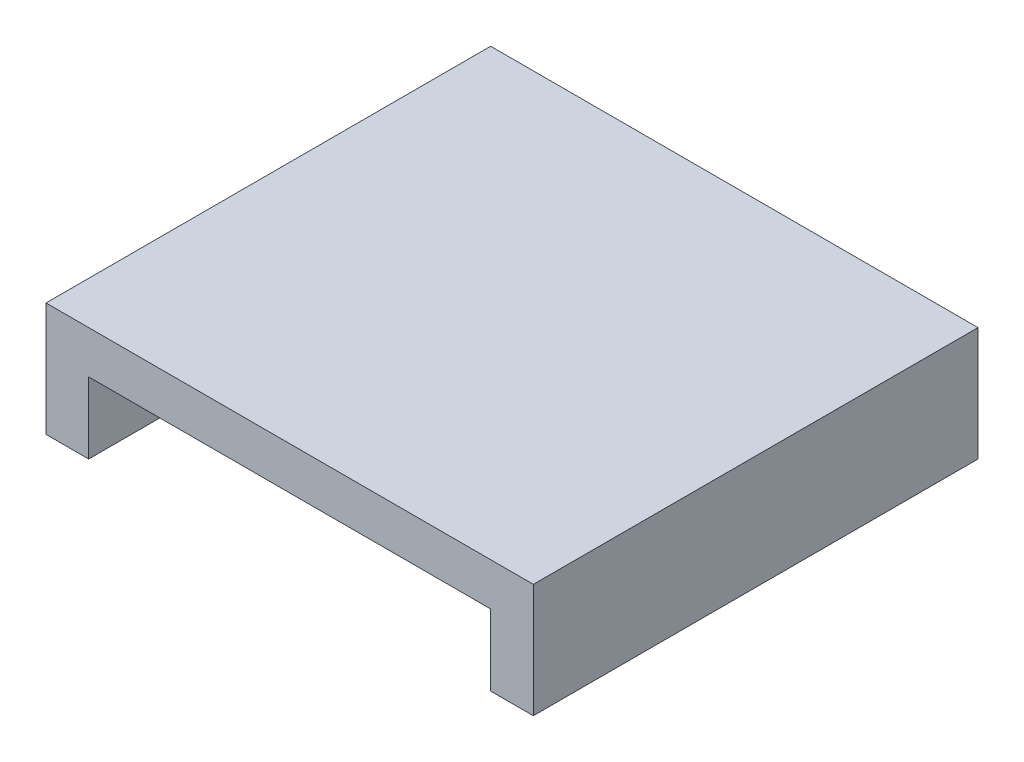
ISO-10303-21;
HEADER;
FILE_DESCRIPTION(('STEP AP214'),'2;1');
FILE_NAME('part.step','',(''),(''),'','','');
FILE_SCHEMA(('AUTOMOTIVE_DESIGN { 1 0 10303 214 1 1 1 1 }'));
ENDSEC;
DATA;
#1=APPLICATION_CONTEXT('core data for automotive mechanical design processes');
#2=APPLICATION_PROTOCOL_DEFINITION('international standard','automotive_design',2000,#1);
#3=PRODUCT_CONTEXT('',#1,'mechanical');
#4=PRODUCT('Part','Part','',(#3));
#5=PRODUCT_RELATED_PRODUCT_CATEGORY('part','',(#4));
#6=PRODUCT_DEFINITION_FORMATION('','',#4);
#7=PRODUCT_DEFINITION_CONTEXT('part definition',#1,'design');
#8=PRODUCT_DEFINITION('design','',#6,#7);
#9=PRODUCT_DEFINITION_SHAPE('','',#8);
#10=(LENGTH_UNIT() NAMED_UNIT(*) SI_UNIT(.MILLI.,.METRE.));
#11=(NAMED_UNIT(*) PLANE_ANGLE_UNIT() SI_UNIT($,.RADIAN.));
#12=(NAMED_UNIT(*) SI_UNIT($,.STERADIAN.) SOLID_ANGLE_UNIT());
#13=UNCERTAINTY_MEASURE_WITH_UNIT(LENGTH_MEASURE(1.E-05),#10,'distance_accuracy_value','');
#14=(GEOMETRIC_REPRESENTATION_CONTEXT(3) GLOBAL_UNCERTAINTY_ASSIGNED_CONTEXT((#13)) GLOBAL_UNIT_ASSIGNED_CONTEXT((#10,
#11,#12)) REPRESENTATION_CONTEXT('',''));
#15=CARTESIAN_POINT('',(0.,0.,0.));
#16=DIRECTION('',(0.,0.,1.));
#17=DIRECTION('',(1.,0.,0.));
#18=AXIS2_PLACEMENT_3D('',#15,#16,#17);
#19=CARTESIAN_POINT('',(0.,0.,0.));
#20=DIRECTION('',(0.,-1.,0.));
#21=DIRECTION('',(0.,0.,-1.));
#22=AXIS2_PLACEMENT_3D('',#19,#20,#21);
#23=PLANE('',#22);
#24=DIRECTION('',(1.,0.,0.));
#25=VECTOR('',#24,1.);
#26=CARTESIAN_POINT('',(-28.25,0.,28.25));
#27=LINE('',#26,#25);
#28=CARTESIAN_POINT('',(28.25,0.,28.25));
#29=VERTEX_POINT('',#28);
#30=CARTESIAN_POINT('',(34.25,0.,28.25));
#31=VERTEX_POINT('',#30);
#32=EDGE_CURVE('E132',#29,#31,#27,.T.);
#33=ORIENTED_EDGE('',*,*,#32,.F.);
#34=DIRECTION('',(0.,0.,-1.));
#35=VECTOR('',#34,1.);
#36=CARTESIAN_POINT('',(28.25,0.,28.25));
#37=LINE('',#36,#35);
#38=CARTESIAN_POINT('',(28.25,0.,-28.25));
#39=VERTEX_POINT('',#38);
#40=EDGE_CURVE('E154',#29,#39,#37,.T.);
#41=ORIENTED_EDGE('',*,*,#40,.T.);
#42=DIRECTION('',(-1.,0.,0.));
#43=VECTOR('',#42,1.);
#44=CARTESIAN_POINT('',(-28.25,0.,-28.25));
#45=LINE('',#44,#43);
#46=CARTESIAN_POINT('',(-28.25,0.,-28.25));
#47=VERTEX_POINT('',#46);
#48=EDGE_CURVE('E151',#39,#47,#45,.T.);
#49=ORIENTED_EDGE('',*,*,#48,.T.);
#50=DIRECTION('',(0.,0.,1.));
#51=VECTOR('',#50,1.);
#52=CARTESIAN_POINT('',(-28.25,0.,28.25));
#53=LINE('',#52,#51);
#54=CARTESIAN_POINT('',(-28.25,0.,28.25));
#55=VERTEX_POINT('',#54);
#56=EDGE_CURVE('E51',#47,#55,#53,.T.);
#57=ORIENTED_EDGE('',*,*,#56,.T.);
#58=CARTESIAN_POINT('',(-34.25,0.,28.25));
#59=VERTEX_POINT('',#58);
#60=EDGE_CURVE('E134',#59,#55,#27,.T.);
#61=ORIENTED_EDGE('',*,*,#60,.F.);
#62=DIRECTION('',(0.,0.,1.));
#63=VECTOR('',#62,1.);
#64=CARTESIAN_POINT('',(-34.25,0.,0.));
#65=LINE('',#64,#63);
#66=CARTESIAN_POINT('',(-34.25,0.,-34.25));
#67=VERTEX_POINT('',#66);
#68=EDGE_CURVE('E131',#67,#59,#65,.T.);
#69=ORIENTED_EDGE('',*,*,#68,.F.);
#70=DIRECTION('',(-1.,0.,0.));
#71=VECTOR('',#70,1.);
#72=CARTESIAN_POINT('',(0.,0.,-34.25));
#73=LINE('',#72,#71);
#74=CARTESIAN_POINT('',(34.25,0.,-34.25));
#75=VERTEX_POINT('',#74);
#76=EDGE_CURVE('E38',#75,#67,#73,.T.);
#77=ORIENTED_EDGE('',*,*,#76,.F.);
#78=DIRECTION('',(0.,0.,-1.));
#79=VECTOR('',#78,1.);
#80=CARTESIAN_POINT('',(34.25,0.,0.));
#81=LINE('',#80,#79);
#82=EDGE_CURVE('E125',#31,#75,#81,.T.);
#83=ORIENTED_EDGE('',*,*,#82,.F.);
#84=EDGE_LOOP('',(#33,#41,#49,#57,#61,#69,#77,#83));
#85=FACE_BOUND('',#84,.T.);
#86=ADVANCED_FACE('F34',(#85),#23,.T.);
#87=CARTESIAN_POINT('',(34.25,10.,28.25));
#88=DIRECTION('',(-1.,0.,0.));
#89=DIRECTION('',(0.,0.,1.));
#90=AXIS2_PLACEMENT_3D('',#87,#88,#89);
#91=PLANE('',#90);
#92=ORIENTED_EDGE('',*,*,#82,.T.);
#93=DIRECTION('',(0.,-1.,0.));
#94=VECTOR('',#93,1.);
#95=CARTESIAN_POINT('',(34.25,10.,-34.25));
#96=LINE('',#95,#94);
#97=CARTESIAN_POINT('',(34.25,16.,-34.25));
#98=VERTEX_POINT('',#97);
#99=EDGE_CURVE('E11',#98,#75,#96,.T.);
#100=ORIENTED_EDGE('',*,*,#99,.F.);
#101=DIRECTION('',(0.,0.,-1.));
#102=VECTOR('',#101,1.);
#103=CARTESIAN_POINT('',(34.25,16.,0.));
#104=LINE('',#103,#102);
#105=CARTESIAN_POINT('',(34.25,16.,28.25));
#106=VERTEX_POINT('',#105);
#107=EDGE_CURVE('E110',#106,#98,#104,.T.);
#108=ORIENTED_EDGE('',*,*,#107,.F.);
#109=DIRECTION('',(0.,-1.,0.));
#110=VECTOR('',#109,1.);
#111=CARTESIAN_POINT('',(34.25,10.,28.25));
#112=LINE('',#111,#110);
#113=EDGE_CURVE('E122',#106,#31,#112,.T.);
#114=ORIENTED_EDGE('',*,*,#113,.T.);
#115=EDGE_LOOP('',(#92,#100,#108,#114));
#116=FACE_BOUND('',#115,.T.);
#117=ADVANCED_FACE('F187',(#116),#91,.F.);
#118=CARTESIAN_POINT('',(-28.25,10.,-34.25));
#119=DIRECTION('',(0.,0.,1.));
#120=DIRECTION('',(1.,0.,0.));
#121=AXIS2_PLACEMENT_3D('',#118,#119,#120);
#122=PLANE('',#121);
#123=ORIENTED_EDGE('',*,*,#76,.T.);
#124=DIRECTION('',(0.,-1.,0.));
#125=VECTOR('',#124,1.);
#126=CARTESIAN_POINT('',(-34.25,10.,-34.25));
#127=LINE('',#126,#125);
#128=CARTESIAN_POINT('',(-34.25,16.,-34.25));
#129=VERTEX_POINT('',#128);
#130=EDGE_CURVE('E43',#129,#67,#127,.T.);
#131=ORIENTED_EDGE('',*,*,#130,.F.);
#132=DIRECTION('',(-1.,0.,0.));
#133=VECTOR('',#132,1.);
#134=CARTESIAN_POINT('',(0.,16.,-34.25));
#135=LINE('',#134,#133);
#136=EDGE_CURVE('E104',#98,#129,#135,.T.);
#137=ORIENTED_EDGE('',*,*,#136,.F.);
#138=ORIENTED_EDGE('',*,*,#99,.T.);
#139=EDGE_LOOP('',(#123,#131,#137,#138));
#140=FACE_BOUND('',#139,.T.);
#141=ADVANCED_FACE('F115',(#140),#122,.F.);
#142=CARTESIAN_POINT('',(-34.25,10.,28.25));
#143=DIRECTION('',(1.,0.,0.));
#144=DIRECTION('',(0.,0.,-1.));
#145=AXIS2_PLACEMENT_3D('',#142,#143,#144);
#146=PLANE('',#145);
#147=ORIENTED_EDGE('',*,*,#68,.T.);
#148=DIRECTION('',(0.,-1.,0.));
#149=VECTOR('',#148,1.);
#150=CARTESIAN_POINT('',(-34.25,10.,28.25));
#151=LINE('',#150,#149);
#152=CARTESIAN_POINT('',(-34.25,16.,28.25));
#153=VERTEX_POINT('',#152);
#154=EDGE_CURVE('E117',#153,#59,#151,.T.);
#155=ORIENTED_EDGE('',*,*,#154,.F.);
#156=DIRECTION('',(0.,0.,1.));
#157=VECTOR('',#156,1.);
#158=CARTESIAN_POINT('',(-34.25,16.,0.));
#159=LINE('',#158,#157);
#160=EDGE_CURVE('E107',#129,#153,#159,.T.);
#161=ORIENTED_EDGE('',*,*,#160,.F.);
#162=ORIENTED_EDGE('',*,*,#130,.T.);
#163=EDGE_LOOP('',(#147,#155,#161,#162));
#164=FACE_BOUND('',#163,.T.);
#165=ADVANCED_FACE('F119',(#164),#146,.F.);
#166=CARTESIAN_POINT('',(-28.25,10.,28.25));
#167=DIRECTION('',(0.,0.,-1.));
#168=DIRECTION('',(-1.,0.,0.));
#169=AXIS2_PLACEMENT_3D('',#166,#167,#168);
#170=PLANE('',#169);
#171=DIRECTION('',(1.,0.,0.));
#172=VECTOR('',#171,1.);
#173=CARTESIAN_POINT('',(-28.25,10.,28.25));
#174=LINE('',#173,#172);
#175=CARTESIAN_POINT('',(-28.25,10.,28.25));
#176=VERTEX_POINT('',#175);
#177=CARTESIAN_POINT('',(28.25,10.,28.25));
#178=VERTEX_POINT('',#177);
#179=EDGE_CURVE('E148',#176,#178,#174,.T.);
#180=ORIENTED_EDGE('',*,*,#179,.T.);
#181=DIRECTION('',(0.,-1.,0.));
#182=VECTOR('',#181,1.);
#183=CARTESIAN_POINT('',(28.25,10.,28.25));
#184=LINE('',#183,#182);
#185=EDGE_CURVE('E86',#178,#29,#184,.T.);
#186=ORIENTED_EDGE('',*,*,#185,.T.);
#187=ORIENTED_EDGE('',*,*,#32,.T.);
#188=ORIENTED_EDGE('',*,*,#113,.F.);
#189=DIRECTION('',(1.,0.,0.));
#190=VECTOR('',#189,1.);
#191=CARTESIAN_POINT('',(0.,16.,28.25));
#192=LINE('',#191,#190);
#193=EDGE_CURVE('E60',#153,#106,#192,.T.);
#194=ORIENTED_EDGE('',*,*,#193,.F.);
#195=ORIENTED_EDGE('',*,*,#154,.T.);
#196=ORIENTED_EDGE('',*,*,#60,.T.);
#197=DIRECTION('',(0.,-1.,0.));
#198=VECTOR('',#197,1.);
#199=CARTESIAN_POINT('',(-28.25,10.,28.25));
#200=LINE('',#199,#198);
#201=EDGE_CURVE('E145',#176,#55,#200,.T.);
#202=ORIENTED_EDGE('',*,*,#201,.F.);
#203=EDGE_LOOP('',(#180,#186,#187,#188,#194,#195,#196,#202));
#204=FACE_BOUND('',#203,.T.);
#205=ADVANCED_FACE('F173',(#204),#170,.F.);
#206=CARTESIAN_POINT('',(0.,16.,0.));
#207=DIRECTION('',(0.,-1.,0.));
#208=DIRECTION('',(0.,0.,-1.));
#209=AXIS2_PLACEMENT_3D('',#206,#207,#208);
#210=PLANE('',#209);
#211=ORIENTED_EDGE('',*,*,#107,.T.);
#212=ORIENTED_EDGE('',*,*,#136,.T.);
#213=ORIENTED_EDGE('',*,*,#160,.T.);
#214=ORIENTED_EDGE('',*,*,#193,.T.);
#215=EDGE_LOOP('',(#211,#212,#213,#214));
#216=FACE_BOUND('',#215,.T.);
#217=ADVANCED_FACE('F36',(#216),#210,.F.);
#218=CARTESIAN_POINT('',(28.25,10.,28.25));
#219=DIRECTION('',(-1.,0.,0.));
#220=DIRECTION('',(0.,0.,1.));
#221=AXIS2_PLACEMENT_3D('',#218,#219,#220);
#222=PLANE('',#221);
#223=ORIENTED_EDGE('',*,*,#40,.F.);
#224=ORIENTED_EDGE('',*,*,#185,.F.);
#225=DIRECTION('',(0.,0.,-1.));
#226=VECTOR('',#225,1.);
#227=CARTESIAN_POINT('',(28.25,10.,28.25));
#228=LINE('',#227,#226);
#229=CARTESIAN_POINT('',(28.25,10.,-28.25));
#230=VERTEX_POINT('',#229);
#231=EDGE_CURVE('E150',#178,#230,#228,.T.);
#232=ORIENTED_EDGE('',*,*,#231,.T.);
#233=DIRECTION('',(0.,-1.,0.));
#234=VECTOR('',#233,1.);
#235=CARTESIAN_POINT('',(28.25,10.,-28.25));
#236=LINE('',#235,#234);
#237=EDGE_CURVE('E128',#230,#39,#236,.T.);
#238=ORIENTED_EDGE('',*,*,#237,.T.);
#239=EDGE_LOOP('',(#223,#224,#232,#238));
#240=FACE_BOUND('',#239,.T.);
#241=ADVANCED_FACE('F165',(#240),#222,.T.);
#242=CARTESIAN_POINT('',(-28.25,10.,-28.25));
#243=DIRECTION('',(0.,0.,1.));
#244=DIRECTION('',(1.,0.,0.));
#245=AXIS2_PLACEMENT_3D('',#242,#243,#244);
#246=PLANE('',#245);
#247=ORIENTED_EDGE('',*,*,#48,.F.);
#248=ORIENTED_EDGE('',*,*,#237,.F.);
#249=DIRECTION('',(-1.,0.,0.));
#250=VECTOR('',#249,1.);
#251=CARTESIAN_POINT('',(-28.25,10.,-28.25));
#252=LINE('',#251,#250);
#253=CARTESIAN_POINT('',(-28.25,10.,-28.25));
#254=VERTEX_POINT('',#253);
#255=EDGE_CURVE('E161',#230,#254,#252,.T.);
#256=ORIENTED_EDGE('',*,*,#255,.T.);
#257=DIRECTION('',(0.,-1.,0.));
#258=VECTOR('',#257,1.);
#259=CARTESIAN_POINT('',(-28.25,10.,-28.25));
#260=LINE('',#259,#258);
#261=EDGE_CURVE('E143',#254,#47,#260,.T.);
#262=ORIENTED_EDGE('',*,*,#261,.T.);
#263=EDGE_LOOP('',(#247,#248,#256,#262));
#264=FACE_BOUND('',#263,.T.);
#265=ADVANCED_FACE('F171',(#264),#246,.T.);
#266=CARTESIAN_POINT('',(-28.25,10.,28.25));
#267=DIRECTION('',(1.,0.,0.));
#268=DIRECTION('',(0.,0.,-1.));
#269=AXIS2_PLACEMENT_3D('',#266,#267,#268);
#270=PLANE('',#269);
#271=ORIENTED_EDGE('',*,*,#56,.F.);
#272=ORIENTED_EDGE('',*,*,#261,.F.);
#273=DIRECTION('',(0.,0.,1.));
#274=VECTOR('',#273,1.);
#275=CARTESIAN_POINT('',(-28.25,10.,28.25));
#276=LINE('',#275,#274);
#277=EDGE_CURVE('E159',#254,#176,#276,.T.);
#278=ORIENTED_EDGE('',*,*,#277,.T.);
#279=ORIENTED_EDGE('',*,*,#201,.T.);
#280=EDGE_LOOP('',(#271,#272,#278,#279));
#281=FACE_BOUND('',#280,.T.);
#282=ADVANCED_FACE('F177',(#281),#270,.T.);
#283=CARTESIAN_POINT('',(0.,10.,0.));
#284=DIRECTION('',(0.,-1.,0.));
#285=DIRECTION('',(0.,0.,-1.));
#286=AXIS2_PLACEMENT_3D('',#283,#284,#285);
#287=PLANE('',#286);
#288=ORIENTED_EDGE('',*,*,#231,.F.);
#289=ORIENTED_EDGE('',*,*,#179,.F.);
#290=ORIENTED_EDGE('',*,*,#277,.F.);
#291=ORIENTED_EDGE('',*,*,#255,.F.);
#292=EDGE_LOOP('',(#288,#289,#290,#291));
#293=FACE_BOUND('',#292,.T.);
#294=ADVANCED_FACE('F176',(#293),#287,.T.);
#295=CLOSED_SHELL('',(#86,#117,#141,#165,#205,#217,#241,#265,#282,#294));
#296=MANIFOLD_SOLID_BREP('B2',#295);
#297=ADVANCED_BREP_SHAPE_REPRESENTATION('',(#18,#296),#14);
#298=SHAPE_DEFINITION_REPRESENTATION(#9,#297);
ENDSEC;
END-ISO-10303-21;
